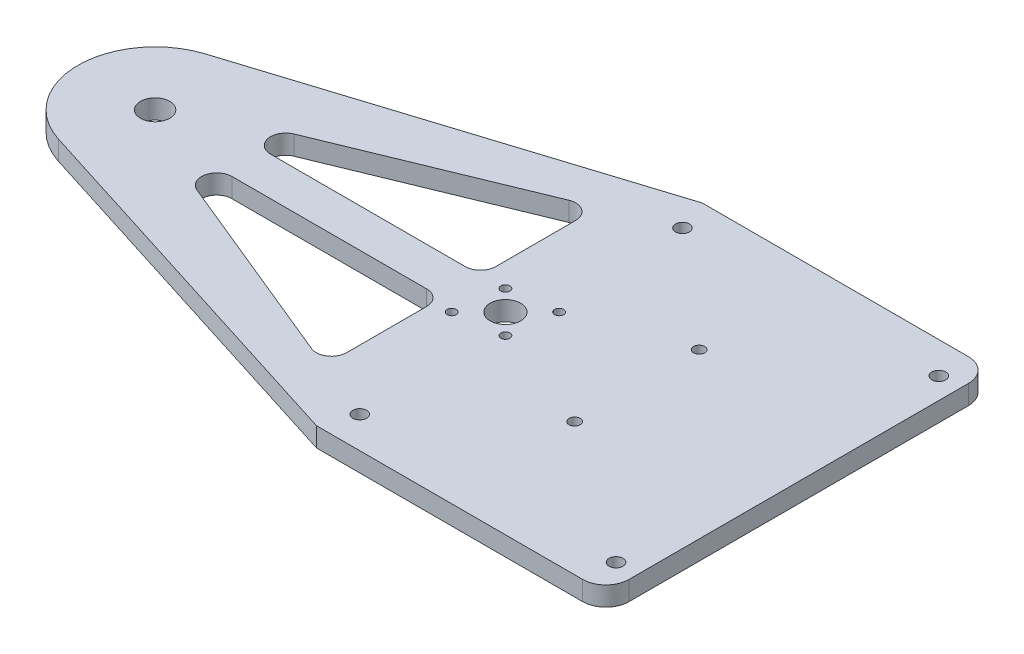
ISO-10303-21;
HEADER;
FILE_DESCRIPTION(('STEP AP214'),'2;1');
FILE_NAME('part.step','',(''),(''),'','','');
FILE_SCHEMA(('AUTOMOTIVE_DESIGN { 1 0 10303 214 1 1 1 1 }'));
ENDSEC;
DATA;
#1=APPLICATION_CONTEXT('core data for automotive mechanical design processes');
#2=APPLICATION_PROTOCOL_DEFINITION('international standard','automotive_design',2000,#1);
#3=PRODUCT_CONTEXT('',#1,'mechanical');
#4=PRODUCT('Part','Part','',(#3));
#5=PRODUCT_RELATED_PRODUCT_CATEGORY('part','',(#4));
#6=PRODUCT_DEFINITION_FORMATION('','',#4);
#7=PRODUCT_DEFINITION_CONTEXT('part definition',#1,'design');
#8=PRODUCT_DEFINITION('design','',#6,#7);
#9=PRODUCT_DEFINITION_SHAPE('','',#8);
#10=(LENGTH_UNIT() NAMED_UNIT(*) SI_UNIT(.MILLI.,.METRE.));
#11=(NAMED_UNIT(*) PLANE_ANGLE_UNIT() SI_UNIT($,.RADIAN.));
#12=(NAMED_UNIT(*) SI_UNIT($,.STERADIAN.) SOLID_ANGLE_UNIT());
#13=UNCERTAINTY_MEASURE_WITH_UNIT(LENGTH_MEASURE(1.E-05),#10,'distance_accuracy_value','');
#14=(GEOMETRIC_REPRESENTATION_CONTEXT(3) GLOBAL_UNCERTAINTY_ASSIGNED_CONTEXT((#13)) GLOBAL_UNIT_ASSIGNED_CONTEXT((#10,
#11,#12)) REPRESENTATION_CONTEXT('',''));
#15=CARTESIAN_POINT('',(0.,0.,0.));
#16=DIRECTION('',(0.,0.,1.));
#17=DIRECTION('',(1.,0.,0.));
#18=AXIS2_PLACEMENT_3D('',#15,#16,#17);
#19=CARTESIAN_POINT('',(47.625,6.35,63.5));
#20=DIRECTION('',(-1.,0.,0.));
#21=DIRECTION('',(0.,0.,1.));
#22=AXIS2_PLACEMENT_3D('',#19,#20,#21);
#23=PLANE('',#22);
#24=DIRECTION('',(0.,0.,-1.));
#25=VECTOR('',#24,1.);
#26=CARTESIAN_POINT('',(47.625,6.35,63.5));
#27=LINE('',#26,#25);
#28=CARTESIAN_POINT('',(47.625,6.35,55.88));
#29=VERTEX_POINT('',#28);
#30=CARTESIAN_POINT('',(47.625,6.35,-55.88));
#31=VERTEX_POINT('',#30);
#32=EDGE_CURVE('E224',#29,#31,#27,.T.);
#33=ORIENTED_EDGE('',*,*,#32,.F.);
#34=DIRECTION('',(0.,-1.,0.));
#35=VECTOR('',#34,1.);
#36=CARTESIAN_POINT('',(47.625,6.35,55.88));
#37=LINE('',#36,#35);
#38=CARTESIAN_POINT('',(47.625,0.,55.88));
#39=VERTEX_POINT('',#38);
#40=EDGE_CURVE('E289',#29,#39,#37,.T.);
#41=ORIENTED_EDGE('',*,*,#40,.T.);
#42=DIRECTION('',(0.,0.,-1.));
#43=VECTOR('',#42,1.);
#44=CARTESIAN_POINT('',(47.625,0.,63.5));
#45=LINE('',#44,#43);
#46=CARTESIAN_POINT('',(47.625,0.,-55.88));
#47=VERTEX_POINT('',#46);
#48=EDGE_CURVE('E186',#39,#47,#45,.T.);
#49=ORIENTED_EDGE('',*,*,#48,.T.);
#50=DIRECTION('',(0.,-1.,0.));
#51=VECTOR('',#50,1.);
#52=CARTESIAN_POINT('',(47.625,6.35,-55.88));
#53=LINE('',#52,#51);
#54=EDGE_CURVE('E287',#47,#31,#53,.F.);
#55=ORIENTED_EDGE('',*,*,#54,.T.);
#56=EDGE_LOOP('',(#33,#41,#49,#55));
#57=FACE_BOUND('',#56,.T.);
#58=ADVANCED_FACE('F38',(#57),#23,.F.);
#59=CARTESIAN_POINT('',(-47.625,6.35,-63.5));
#60=DIRECTION('',(0.,0.,1.));
#61=DIRECTION('',(1.,0.,0.));
#62=AXIS2_PLACEMENT_3D('',#59,#60,#61);
#63=PLANE('',#62);
#64=DIRECTION('',(-1.,0.,0.));
#65=VECTOR('',#64,1.);
#66=CARTESIAN_POINT('',(-47.625,6.35,-63.5));
#67=LINE('',#66,#65);
#68=CARTESIAN_POINT('',(40.005,6.35,-63.5));
#69=VERTEX_POINT('',#68);
#70=CARTESIAN_POINT('',(-47.625,6.35,-63.5));
#71=VERTEX_POINT('',#70);
#72=EDGE_CURVE('E226',#69,#71,#67,.T.);
#73=ORIENTED_EDGE('',*,*,#72,.F.);
#74=DIRECTION('',(0.,-1.,0.));
#75=VECTOR('',#74,1.);
#76=CARTESIAN_POINT('',(40.005,6.35,-63.5));
#77=LINE('',#76,#75);
#78=CARTESIAN_POINT('',(40.005,0.,-63.5));
#79=VERTEX_POINT('',#78);
#80=EDGE_CURVE('E11',#69,#79,#77,.T.);
#81=ORIENTED_EDGE('',*,*,#80,.T.);
#82=DIRECTION('',(-1.,0.,0.));
#83=VECTOR('',#82,1.);
#84=CARTESIAN_POINT('',(-47.625,0.,-63.5));
#85=LINE('',#84,#83);
#86=CARTESIAN_POINT('',(-47.625,0.,-63.5));
#87=VERTEX_POINT('',#86);
#88=EDGE_CURVE('E177',#79,#87,#85,.T.);
#89=ORIENTED_EDGE('',*,*,#88,.T.);
#90=DIRECTION('',(0.,-1.,0.));
#91=VECTOR('',#90,1.);
#92=CARTESIAN_POINT('',(-47.625,6.35,-63.5));
#93=LINE('',#92,#91);
#94=EDGE_CURVE('E180',#71,#87,#93,.T.);
#95=ORIENTED_EDGE('',*,*,#94,.F.);
#96=EDGE_LOOP('',(#73,#81,#89,#95));
#97=FACE_BOUND('',#96,.T.);
#98=ADVANCED_FACE('F179',(#97),#63,.F.);
#99=CARTESIAN_POINT('',(-47.625,6.35,63.5));
#100=DIRECTION('',(0.,0.,-1.));
#101=DIRECTION('',(-1.,0.,0.));
#102=AXIS2_PLACEMENT_3D('',#99,#100,#101);
#103=PLANE('',#102);
#104=DIRECTION('',(1.,0.,0.));
#105=VECTOR('',#104,1.);
#106=CARTESIAN_POINT('',(-47.625,0.,63.5));
#107=LINE('',#106,#105);
#108=CARTESIAN_POINT('',(-47.625,0.,63.5));
#109=VERTEX_POINT('',#108);
#110=CARTESIAN_POINT('',(40.005,0.,63.5));
#111=VERTEX_POINT('',#110);
#112=EDGE_CURVE('E185',#109,#111,#107,.T.);
#113=ORIENTED_EDGE('',*,*,#112,.T.);
#114=DIRECTION('',(0.,-1.,0.));
#115=VECTOR('',#114,1.);
#116=CARTESIAN_POINT('',(40.005,6.35,63.5));
#117=LINE('',#116,#115);
#118=CARTESIAN_POINT('',(40.005,6.35,63.5));
#119=VERTEX_POINT('',#118);
#120=EDGE_CURVE('E61',#111,#119,#117,.F.);
#121=ORIENTED_EDGE('',*,*,#120,.T.);
#122=DIRECTION('',(1.,0.,0.));
#123=VECTOR('',#122,1.);
#124=CARTESIAN_POINT('',(-47.625,6.35,63.5));
#125=LINE('',#124,#123);
#126=CARTESIAN_POINT('',(-47.625,6.35,63.5));
#127=VERTEX_POINT('',#126);
#128=EDGE_CURVE('E228',#127,#119,#125,.T.);
#129=ORIENTED_EDGE('',*,*,#128,.F.);
#130=DIRECTION('',(0.,-1.,0.));
#131=VECTOR('',#130,1.);
#132=CARTESIAN_POINT('',(-47.625,6.35,63.5));
#133=LINE('',#132,#131);
#134=EDGE_CURVE('E195',#127,#109,#133,.T.);
#135=ORIENTED_EDGE('',*,*,#134,.T.);
#136=EDGE_LOOP('',(#113,#121,#129,#135));
#137=FACE_BOUND('',#136,.T.);
#138=ADVANCED_FACE('F306',(#137),#103,.F.);
#139=CARTESIAN_POINT('',(0.,6.35,0.));
#140=DIRECTION('',(0.,-1.,0.));
#141=DIRECTION('',(0.,0.,-1.));
#142=AXIS2_PLACEMENT_3D('',#139,#140,#141);
#143=PLANE('',#142);
#144=CARTESIAN_POINT('',(-6.32846504664037,6.35,19.8289248425364));
#145=DIRECTION('',(0.,1.,0.));
#146=DIRECTION('',(0.,0.,1.));
#147=AXIS2_PLACEMENT_3D('',#144,#145,#146);
#148=CIRCLE('',#147,1.83000808299);
#149=CARTESIAN_POINT('',(-6.32846504664037,6.35,21.6589329255264));
#150=VERTEX_POINT('',#149);
#151=EDGE_CURVE('E530',#150,#150,#148,.T.);
#152=ORIENTED_EDGE('',*,*,#151,.F.);
#153=EDGE_LOOP('',(#152));
#154=FACE_BOUND('',#153,.T.);
#155=CARTESIAN_POINT('',(-6.32833804564912,6.35,-21.1714909607088));
#156=DIRECTION('',(0.,1.,0.));
#157=DIRECTION('',(0.,0.,1.));
#158=AXIS2_PLACEMENT_3D('',#155,#156,#157);
#159=CIRCLE('',#158,1.83000808299);
#160=CARTESIAN_POINT('',(-6.32833804564912,6.35,-19.3414828777188));
#161=VERTEX_POINT('',#160);
#162=EDGE_CURVE('E524',#161,#161,#159,.T.);
#163=ORIENTED_EDGE('',*,*,#162,.F.);
#164=EDGE_LOOP('',(#163));
#165=FACE_BOUND('',#164,.T.);
#166=CARTESIAN_POINT('',(40.6022546113919,6.35,53.1253834931554));
#167=DIRECTION('',(0.,1.,0.));
#168=DIRECTION('',(0.,0.,1.));
#169=AXIS2_PLACEMENT_3D('',#166,#167,#168);
#170=CIRCLE('',#169,2.2812375);
#171=CARTESIAN_POINT('',(40.6022546113919,6.35,55.4066209931554));
#172=VERTEX_POINT('',#171);
#173=EDGE_CURVE('E506',#172,#172,#170,.T.);
#174=ORIENTED_EDGE('',*,*,#173,.F.);
#175=EDGE_LOOP('',(#174));
#176=FACE_BOUND('',#175,.T.);
#177=CARTESIAN_POINT('',(40.6022546113918,6.35,-53.1253834931555));
#178=DIRECTION('',(0.,1.,0.));
#179=DIRECTION('',(0.,0.,1.));
#180=AXIS2_PLACEMENT_3D('',#177,#178,#179);
#181=CIRCLE('',#180,2.2812375);
#182=CARTESIAN_POINT('',(40.6022546113918,6.35,-50.8441459931555));
#183=VERTEX_POINT('',#182);
#184=EDGE_CURVE('E513',#183,#183,#181,.T.);
#185=ORIENTED_EDGE('',*,*,#184,.F.);
#186=EDGE_LOOP('',(#185));
#187=FACE_BOUND('',#186,.T.);
#188=CARTESIAN_POINT('',(-43.7772546113918,6.35,-53.1253834931554));
#189=DIRECTION('',(0.,1.,0.));
#190=DIRECTION('',(0.,0.,1.));
#191=AXIS2_PLACEMENT_3D('',#188,#189,#190);
#192=CIRCLE('',#191,2.2812375);
#193=CARTESIAN_POINT('',(-43.7772546113918,6.35,-50.8441459931554));
#194=VERTEX_POINT('',#193);
#195=EDGE_CURVE('E519',#194,#194,#192,.T.);
#196=ORIENTED_EDGE('',*,*,#195,.F.);
#197=EDGE_LOOP('',(#196));
#198=FACE_BOUND('',#197,.T.);
#199=CARTESIAN_POINT('',(-43.7772546113918,6.35,53.1253834931554));
#200=DIRECTION('',(0.,1.,0.));
#201=DIRECTION('',(0.,0.,1.));
#202=AXIS2_PLACEMENT_3D('',#199,#200,#201);
#203=CIRCLE('',#202,2.2812375);
#204=CARTESIAN_POINT('',(-43.7772546113918,6.35,55.4066209931554));
#205=VERTEX_POINT('',#204);
#206=EDGE_CURVE('E500',#205,#205,#203,.T.);
#207=ORIENTED_EDGE('',*,*,#206,.F.);
#208=EDGE_LOOP('',(#207));
#209=FACE_BOUND('',#208,.T.);
#210=DIRECTION('',(-0.924890770713384,0.,0.380232905268865));
#211=VECTOR('',#210,1.);
#212=CARTESIAN_POINT('',(-63.5,6.35,-45.1637433547681));
#213=LINE('',#212,#211);
#214=CARTESIAN_POINT('',(-70.4011645263443,6.35,-42.3265976931606));
#215=VERTEX_POINT('',#214);
#216=CARTESIAN_POINT('',(-134.500968325591,6.35,-15.9744538535669));
#217=VERTEX_POINT('',#216);
#218=EDGE_CURVE('E488',#215,#217,#213,.T.);
#219=ORIENTED_EDGE('',*,*,#218,.F.);
#220=CARTESIAN_POINT('',(-68.5,6.35,-37.7021438395937));
#221=DIRECTION('',(0.,-1.,0.));
#222=DIRECTION('',(0.,0.,-1.));
#223=AXIS2_PLACEMENT_3D('',#220,#221,#222);
#224=CIRCLE('',#223,5.);
#225=CARTESIAN_POINT('',(-63.5,6.35,-37.7021438395937));
#226=VERTEX_POINT('',#225);
#227=EDGE_CURVE('E283',#215,#226,#224,.T.);
#228=ORIENTED_EDGE('',*,*,#227,.T.);
#229=DIRECTION('',(0.,0.,-1.));
#230=VECTOR('',#229,1.);
#231=CARTESIAN_POINT('',(-63.5,6.35,-6.34999999999999));
#232=LINE('',#231,#230);
#233=CARTESIAN_POINT('',(-63.5,6.35,-11.35));
#234=VERTEX_POINT('',#233);
#235=EDGE_CURVE('E478',#234,#226,#232,.T.);
#236=ORIENTED_EDGE('',*,*,#235,.F.);
#237=CARTESIAN_POINT('',(-68.5,6.35,-11.35));
#238=DIRECTION('',(0.,-1.,0.));
#239=DIRECTION('',(0.,0.,-1.));
#240=AXIS2_PLACEMENT_3D('',#237,#238,#239);
#241=CIRCLE('',#240,5.);
#242=CARTESIAN_POINT('',(-68.5,6.35,-6.34999999999999));
#243=VERTEX_POINT('',#242);
#244=EDGE_CURVE('E275',#234,#243,#241,.T.);
#245=ORIENTED_EDGE('',*,*,#244,.T.);
#246=DIRECTION('',(1.,0.,0.));
#247=VECTOR('',#246,1.);
#248=CARTESIAN_POINT('',(-157.9118,6.35,-6.34999999999997));
#249=LINE('',#248,#247);
#250=CARTESIAN_POINT('',(-132.599803799247,6.35,-6.34999999999998));
#251=VERTEX_POINT('',#250);
#252=EDGE_CURVE('E484',#251,#243,#249,.T.);
#253=ORIENTED_EDGE('',*,*,#252,.F.);
#254=CARTESIAN_POINT('',(-132.599803799247,6.35,-11.35));
#255=DIRECTION('',(0.,-1.,0.));
#256=DIRECTION('',(0.,0.,-1.));
#257=AXIS2_PLACEMENT_3D('',#254,#255,#256);
#258=CIRCLE('',#257,5.);
#259=EDGE_CURVE('E279',#251,#217,#258,.T.);
#260=ORIENTED_EDGE('',*,*,#259,.T.);
#261=EDGE_LOOP('',(#219,#228,#236,#245,#253,#260));
#262=FACE_BOUND('',#261,.T.);
#263=DIRECTION('',(0.924890770713385,0.,0.380232905268865));
#264=VECTOR('',#263,1.);
#265=CARTESIAN_POINT('',(-63.5,6.35,45.1637433547681));
#266=LINE('',#265,#264);
#267=CARTESIAN_POINT('',(-134.500968325591,6.35,15.9744538535669));
#268=VERTEX_POINT('',#267);
#269=CARTESIAN_POINT('',(-70.4011645263443,6.35,42.3265976931606));
#270=VERTEX_POINT('',#269);
#271=EDGE_CURVE('E468',#268,#270,#266,.T.);
#272=ORIENTED_EDGE('',*,*,#271,.F.);
#273=CARTESIAN_POINT('',(-132.599803799247,6.35,11.35));
#274=DIRECTION('',(0.,-1.,0.));
#275=DIRECTION('',(0.,0.,-1.));
#276=AXIS2_PLACEMENT_3D('',#273,#274,#275);
#277=CIRCLE('',#276,5.);
#278=CARTESIAN_POINT('',(-132.599803799247,6.35,6.35000000000001));
#279=VERTEX_POINT('',#278);
#280=EDGE_CURVE('E263',#268,#279,#277,.T.);
#281=ORIENTED_EDGE('',*,*,#280,.T.);
#282=DIRECTION('',(-1.,0.,0.));
#283=VECTOR('',#282,1.);
#284=CARTESIAN_POINT('',(-157.9118,6.35,6.35000000000001));
#285=LINE('',#284,#283);
#286=CARTESIAN_POINT('',(-68.5,6.35,6.35000000000001));
#287=VERTEX_POINT('',#286);
#288=EDGE_CURVE('E471',#287,#279,#285,.T.);
#289=ORIENTED_EDGE('',*,*,#288,.F.);
#290=CARTESIAN_POINT('',(-68.5,6.35,11.35));
#291=DIRECTION('',(0.,-1.,0.));
#292=DIRECTION('',(0.,0.,-1.));
#293=AXIS2_PLACEMENT_3D('',#290,#291,#292);
#294=CIRCLE('',#293,5.);
#295=CARTESIAN_POINT('',(-63.5,6.35,11.35));
#296=VERTEX_POINT('',#295);
#297=EDGE_CURVE('E267',#287,#296,#294,.T.);
#298=ORIENTED_EDGE('',*,*,#297,.T.);
#299=DIRECTION('',(0.,0.,-1.));
#300=VECTOR('',#299,1.);
#301=CARTESIAN_POINT('',(-63.5,6.35,6.35000000000001));
#302=LINE('',#301,#300);
#303=CARTESIAN_POINT('',(-63.5,6.35,37.7021438395937));
#304=VERTEX_POINT('',#303);
#305=EDGE_CURVE('E464',#304,#296,#302,.T.);
#306=ORIENTED_EDGE('',*,*,#305,.F.);
#307=CARTESIAN_POINT('',(-68.5,6.35,37.7021438395937));
#308=DIRECTION('',(0.,-1.,0.));
#309=DIRECTION('',(0.,0.,-1.));
#310=AXIS2_PLACEMENT_3D('',#307,#308,#309);
#311=CIRCLE('',#310,5.);
#312=EDGE_CURVE('E271',#304,#270,#311,.T.);
#313=ORIENTED_EDGE('',*,*,#312,.T.);
#314=EDGE_LOOP('',(#272,#281,#289,#298,#306,#313));
#315=FACE_BOUND('',#314,.T.);
#316=CARTESIAN_POINT('',(-164.2618,6.35,0.));
#317=DIRECTION('',(0.,1.,0.));
#318=DIRECTION('',(0.,0.,1.));
#319=AXIS2_PLACEMENT_3D('',#316,#317,#318);
#320=CIRCLE('',#319,4.82599999999999);
#321=CARTESIAN_POINT('',(-164.2618,6.35,4.82599999999999));
#322=VERTEX_POINT('',#321);
#323=EDGE_CURVE('E453',#322,#322,#320,.T.);
#324=ORIENTED_EDGE('',*,*,#323,.F.);
#325=EDGE_LOOP('',(#324));
#326=FACE_BOUND('',#325,.T.);
#327=CARTESIAN_POINT('',(-42.2282855787278,6.35,6.71751442127221));
#328=DIRECTION('',(0.,1.,0.));
#329=DIRECTION('',(0.,0.,1.));
#330=AXIS2_PLACEMENT_3D('',#327,#328,#329);
#331=CIRCLE('',#330,1.50000000000004);
#332=CARTESIAN_POINT('',(-42.2282855787278,6.35,8.21751442127225));
#333=VERTEX_POINT('',#332);
#334=EDGE_CURVE('E437',#333,#333,#331,.T.);
#335=ORIENTED_EDGE('',*,*,#334,.F.);
#336=EDGE_LOOP('',(#335));
#337=FACE_BOUND('',#336,.T.);
#338=CARTESIAN_POINT('',(-55.6633144212722,6.35,-6.71751442127223));
#339=DIRECTION('',(0.,1.,0.));
#340=DIRECTION('',(0.,0.,1.));
#341=AXIS2_PLACEMENT_3D('',#338,#339,#340);
#342=CIRCLE('',#341,1.50000000000004);
#343=CARTESIAN_POINT('',(-55.6633144212722,6.35,-5.21751442127219));
#344=VERTEX_POINT('',#343);
#345=EDGE_CURVE('E431',#344,#344,#342,.T.);
#346=ORIENTED_EDGE('',*,*,#345,.F.);
#347=EDGE_LOOP('',(#346));
#348=FACE_BOUND('',#347,.T.);
#349=CARTESIAN_POINT('',(-57.7846347648318,6.35,8.83883476483181));
#350=DIRECTION('',(0.,1.,0.));
#351=DIRECTION('',(0.,0.,1.));
#352=AXIS2_PLACEMENT_3D('',#349,#350,#351);
#353=CIRCLE('',#352,1.50000000000004);
#354=CARTESIAN_POINT('',(-57.7846347648318,6.35,10.3388347648319));
#355=VERTEX_POINT('',#354);
#356=EDGE_CURVE('E435',#355,#355,#353,.T.);
#357=ORIENTED_EDGE('',*,*,#356,.F.);
#358=EDGE_LOOP('',(#357));
#359=FACE_BOUND('',#358,.T.);
#360=CARTESIAN_POINT('',(-40.1069652351681,6.35,-8.83883476483183));
#361=DIRECTION('',(0.,1.,0.));
#362=DIRECTION('',(0.,0.,1.));
#363=AXIS2_PLACEMENT_3D('',#360,#361,#362);
#364=CIRCLE('',#363,1.50000000000004);
#365=CARTESIAN_POINT('',(-40.1069652351681,6.35,-7.33883476483179));
#366=VERTEX_POINT('',#365);
#367=EDGE_CURVE('E444',#366,#366,#364,.T.);
#368=ORIENTED_EDGE('',*,*,#367,.F.);
#369=EDGE_LOOP('',(#368));
#370=FACE_BOUND('',#369,.T.);
#371=CARTESIAN_POINT('',(-48.9458,6.35,0.));
#372=DIRECTION('',(0.,1.,0.));
#373=DIRECTION('',(0.,0.,1.));
#374=AXIS2_PLACEMENT_3D('',#371,#372,#373);
#375=CIRCLE('',#374,5.039999953);
#376=CARTESIAN_POINT('',(-48.9458,6.35,5.039999953));
#377=VERTEX_POINT('',#376);
#378=EDGE_CURVE('E450',#377,#377,#375,.T.);
#379=ORIENTED_EDGE('',*,*,#378,.F.);
#380=EDGE_LOOP('',(#379));
#381=FACE_BOUND('',#380,.T.);
#382=ORIENTED_EDGE('',*,*,#128,.T.);
#383=CARTESIAN_POINT('',(40.005,6.35,55.88));
#384=DIRECTION('',(0.,-1.,0.));
#385=DIRECTION('',(0.,0.,-1.));
#386=AXIS2_PLACEMENT_3D('',#383,#384,#385);
#387=CIRCLE('',#386,7.62);
#388=EDGE_CURVE('E46',#119,#29,#387,.F.);
#389=ORIENTED_EDGE('',*,*,#388,.T.);
#390=ORIENTED_EDGE('',*,*,#32,.T.);
#391=CARTESIAN_POINT('',(40.005,6.35,-55.88));
#392=DIRECTION('',(0.,-1.,0.));
#393=DIRECTION('',(0.,0.,-1.));
#394=AXIS2_PLACEMENT_3D('',#391,#392,#393);
#395=CIRCLE('',#394,7.62);
#396=EDGE_CURVE('E53',#31,#69,#395,.F.);
#397=ORIENTED_EDGE('',*,*,#396,.T.);
#398=ORIENTED_EDGE('',*,*,#72,.T.);
#399=DIRECTION('',(-0.953514489025035,0.,0.301347173903003));
#400=VECTOR('',#399,1.);
#401=CARTESIAN_POINT('',(-47.625,6.35,-63.5));
#402=LINE('',#401,#400);
#403=CARTESIAN_POINT('',(-171.916018217136,6.35,-24.2192680212359));
#404=VERTEX_POINT('',#403);
#405=EDGE_CURVE('E193',#71,#404,#402,.T.);
#406=ORIENTED_EDGE('',*,*,#405,.T.);
#407=CARTESIAN_POINT('',(-164.2618,6.35,0.));
#408=DIRECTION('',(0.,1.,0.));
#409=DIRECTION('',(0.,0.,1.));
#410=AXIS2_PLACEMENT_3D('',#407,#408,#409);
#411=CIRCLE('',#410,25.4);
#412=CARTESIAN_POINT('',(-171.916018217136,6.35,24.2192680212359));
#413=VERTEX_POINT('',#412);
#414=EDGE_CURVE('E208',#404,#413,#411,.T.);
#415=ORIENTED_EDGE('',*,*,#414,.T.);
#416=DIRECTION('',(0.953514489025035,0.,0.301347173903003));
#417=VECTOR('',#416,1.);
#418=CARTESIAN_POINT('',(-47.625,6.35,63.5));
#419=LINE('',#418,#417);
#420=EDGE_CURVE('E203',#413,#127,#419,.T.);
#421=ORIENTED_EDGE('',*,*,#420,.T.);
#422=EDGE_LOOP('',(#382,#389,#390,#397,#398,#406,#415,#421));
#423=FACE_BOUND('',#422,.T.);
#424=ADVANCED_FACE('F299',(#154,#165,#176,#187,#198,#209,#262,#315,#326,#337,#348,#359,#370,
#381,#423),#143,.F.);
#425=CARTESIAN_POINT('',(0.,0.,0.));
#426=DIRECTION('',(0.,-1.,0.));
#427=DIRECTION('',(0.,0.,-1.));
#428=AXIS2_PLACEMENT_3D('',#425,#426,#427);
#429=PLANE('',#428);
#430=CARTESIAN_POINT('',(-6.32846504664037,0.,19.8289248425364));
#431=DIRECTION('',(0.,1.,0.));
#432=DIRECTION('',(0.,0.,1.));
#433=AXIS2_PLACEMENT_3D('',#430,#431,#432);
#434=CIRCLE('',#433,1.83000808299);
#435=CARTESIAN_POINT('',(-6.32846504664037,0.,21.6589329255264));
#436=VERTEX_POINT('',#435);
#437=EDGE_CURVE('E510',#436,#436,#434,.T.);
#438=ORIENTED_EDGE('',*,*,#437,.T.);
#439=EDGE_LOOP('',(#438));
#440=FACE_BOUND('',#439,.T.);
#441=CARTESIAN_POINT('',(-6.32833804564912,0.,-21.1714909607088));
#442=DIRECTION('',(0.,1.,0.));
#443=DIRECTION('',(0.,0.,1.));
#444=AXIS2_PLACEMENT_3D('',#441,#442,#443);
#445=CIRCLE('',#444,1.83000808299);
#446=CARTESIAN_POINT('',(-6.32833804564912,0.,-19.3414828777188));
#447=VERTEX_POINT('',#446);
#448=EDGE_CURVE('E527',#447,#447,#445,.T.);
#449=ORIENTED_EDGE('',*,*,#448,.T.);
#450=EDGE_LOOP('',(#449));
#451=FACE_BOUND('',#450,.T.);
#452=CARTESIAN_POINT('',(40.6022546113919,0.,53.1253834931554));
#453=DIRECTION('',(0.,1.,0.));
#454=DIRECTION('',(0.,0.,1.));
#455=AXIS2_PLACEMENT_3D('',#452,#453,#454);
#456=CIRCLE('',#455,2.2812375);
#457=CARTESIAN_POINT('',(40.6022546113919,0.,55.4066209931554));
#458=VERTEX_POINT('',#457);
#459=EDGE_CURVE('E509',#458,#458,#456,.T.);
#460=ORIENTED_EDGE('',*,*,#459,.T.);
#461=EDGE_LOOP('',(#460));
#462=FACE_BOUND('',#461,.T.);
#463=CARTESIAN_POINT('',(40.6022546113918,0.,-53.1253834931555));
#464=DIRECTION('',(0.,1.,0.));
#465=DIRECTION('',(0.,0.,1.));
#466=AXIS2_PLACEMENT_3D('',#463,#464,#465);
#467=CIRCLE('',#466,2.2812375);
#468=CARTESIAN_POINT('',(40.6022546113918,0.,-50.8441459931555));
#469=VERTEX_POINT('',#468);
#470=EDGE_CURVE('E516',#469,#469,#467,.T.);
#471=ORIENTED_EDGE('',*,*,#470,.T.);
#472=EDGE_LOOP('',(#471));
#473=FACE_BOUND('',#472,.T.);
#474=CARTESIAN_POINT('',(-43.7772546113918,0.,-53.1253834931554));
#475=DIRECTION('',(0.,1.,0.));
#476=DIRECTION('',(0.,0.,1.));
#477=AXIS2_PLACEMENT_3D('',#474,#475,#476);
#478=CIRCLE('',#477,2.2812375);
#479=CARTESIAN_POINT('',(-43.7772546113918,0.,-50.8441459931554));
#480=VERTEX_POINT('',#479);
#481=EDGE_CURVE('E503',#480,#480,#478,.T.);
#482=ORIENTED_EDGE('',*,*,#481,.T.);
#483=EDGE_LOOP('',(#482));
#484=FACE_BOUND('',#483,.T.);
#485=CARTESIAN_POINT('',(-43.7772546113918,0.,53.1253834931554));
#486=DIRECTION('',(0.,1.,0.));
#487=DIRECTION('',(0.,0.,1.));
#488=AXIS2_PLACEMENT_3D('',#485,#486,#487);
#489=CIRCLE('',#488,2.2812375);
#490=CARTESIAN_POINT('',(-43.7772546113918,0.,55.4066209931554));
#491=VERTEX_POINT('',#490);
#492=EDGE_CURVE('E474',#491,#491,#489,.T.);
#493=ORIENTED_EDGE('',*,*,#492,.T.);
#494=EDGE_LOOP('',(#493));
#495=FACE_BOUND('',#494,.T.);
#496=DIRECTION('',(1.,0.,0.));
#497=VECTOR('',#496,1.);
#498=CARTESIAN_POINT('',(-157.9118,0.,-6.34999999999997));
#499=LINE('',#498,#497);
#500=CARTESIAN_POINT('',(-132.599803799247,0.,-6.34999999999998));
#501=VERTEX_POINT('',#500);
#502=CARTESIAN_POINT('',(-68.5,0.,-6.34999999999999));
#503=VERTEX_POINT('',#502);
#504=EDGE_CURVE('E457',#501,#503,#499,.T.);
#505=ORIENTED_EDGE('',*,*,#504,.T.);
#506=CARTESIAN_POINT('',(-68.5,0.,-11.35));
#507=DIRECTION('',(0.,-1.,0.));
#508=DIRECTION('',(0.,0.,-1.));
#509=AXIS2_PLACEMENT_3D('',#506,#507,#508);
#510=CIRCLE('',#509,5.);
#511=CARTESIAN_POINT('',(-63.5,0.,-11.35));
#512=VERTEX_POINT('',#511);
#513=EDGE_CURVE('E277',#503,#512,#510,.F.);
#514=ORIENTED_EDGE('',*,*,#513,.T.);
#515=DIRECTION('',(0.,0.,-1.));
#516=VECTOR('',#515,1.);
#517=CARTESIAN_POINT('',(-63.5,0.,-6.34999999999999));
#518=LINE('',#517,#516);
#519=CARTESIAN_POINT('',(-63.5,0.,-37.7021438395937));
#520=VERTEX_POINT('',#519);
#521=EDGE_CURVE('E487',#512,#520,#518,.T.);
#522=ORIENTED_EDGE('',*,*,#521,.T.);
#523=CARTESIAN_POINT('',(-68.5,0.,-37.7021438395937));
#524=DIRECTION('',(0.,-1.,0.));
#525=DIRECTION('',(0.,0.,-1.));
#526=AXIS2_PLACEMENT_3D('',#523,#524,#525);
#527=CIRCLE('',#526,5.);
#528=CARTESIAN_POINT('',(-70.4011645263443,0.,-42.3265976931606));
#529=VERTEX_POINT('',#528);
#530=EDGE_CURVE('E285',#520,#529,#527,.F.);
#531=ORIENTED_EDGE('',*,*,#530,.T.);
#532=DIRECTION('',(-0.924890770713384,0.,0.380232905268865));
#533=VECTOR('',#532,1.);
#534=CARTESIAN_POINT('',(-63.5,0.,-45.1637433547681));
#535=LINE('',#534,#533);
#536=CARTESIAN_POINT('',(-134.500968325591,0.,-15.9744538535669));
#537=VERTEX_POINT('',#536);
#538=EDGE_CURVE('E495',#529,#537,#535,.T.);
#539=ORIENTED_EDGE('',*,*,#538,.T.);
#540=CARTESIAN_POINT('',(-132.599803799247,0.,-11.35));
#541=DIRECTION('',(0.,-1.,0.));
#542=DIRECTION('',(0.,0.,-1.));
#543=AXIS2_PLACEMENT_3D('',#540,#541,#542);
#544=CIRCLE('',#543,5.);
#545=EDGE_CURVE('E281',#537,#501,#544,.F.);
#546=ORIENTED_EDGE('',*,*,#545,.T.);
#547=EDGE_LOOP('',(#505,#514,#522,#531,#539,#546));
#548=FACE_BOUND('',#547,.T.);
#549=DIRECTION('',(0.,0.,-1.));
#550=VECTOR('',#549,1.);
#551=CARTESIAN_POINT('',(-63.5,0.,6.35000000000001));
#552=LINE('',#551,#550);
#553=CARTESIAN_POINT('',(-63.5,0.,37.7021438395937));
#554=VERTEX_POINT('',#553);
#555=CARTESIAN_POINT('',(-63.5,0.,11.35));
#556=VERTEX_POINT('',#555);
#557=EDGE_CURVE('E475',#554,#556,#552,.T.);
#558=ORIENTED_EDGE('',*,*,#557,.T.);
#559=CARTESIAN_POINT('',(-68.5,0.,11.35));
#560=DIRECTION('',(0.,-1.,0.));
#561=DIRECTION('',(0.,0.,-1.));
#562=AXIS2_PLACEMENT_3D('',#559,#560,#561);
#563=CIRCLE('',#562,5.);
#564=CARTESIAN_POINT('',(-68.5,0.,6.35000000000001));
#565=VERTEX_POINT('',#564);
#566=EDGE_CURVE('E269',#556,#565,#563,.F.);
#567=ORIENTED_EDGE('',*,*,#566,.T.);
#568=DIRECTION('',(-1.,0.,0.));
#569=VECTOR('',#568,1.);
#570=CARTESIAN_POINT('',(-157.9118,0.,6.35000000000001));
#571=LINE('',#570,#569);
#572=CARTESIAN_POINT('',(-132.599803799247,0.,6.35000000000001));
#573=VERTEX_POINT('',#572);
#574=EDGE_CURVE('E467',#565,#573,#571,.T.);
#575=ORIENTED_EDGE('',*,*,#574,.T.);
#576=CARTESIAN_POINT('',(-132.599803799247,0.,11.35));
#577=DIRECTION('',(0.,-1.,0.));
#578=DIRECTION('',(0.,0.,-1.));
#579=AXIS2_PLACEMENT_3D('',#576,#577,#578);
#580=CIRCLE('',#579,5.);
#581=CARTESIAN_POINT('',(-134.500968325591,0.,15.9744538535669));
#582=VERTEX_POINT('',#581);
#583=EDGE_CURVE('E265',#573,#582,#580,.F.);
#584=ORIENTED_EDGE('',*,*,#583,.T.);
#585=DIRECTION('',(0.924890770713385,0.,0.380232905268865));
#586=VECTOR('',#585,1.);
#587=CARTESIAN_POINT('',(-63.5,0.,45.1637433547681));
#588=LINE('',#587,#586);
#589=CARTESIAN_POINT('',(-70.4011645263443,0.,42.3265976931606));
#590=VERTEX_POINT('',#589);
#591=EDGE_CURVE('E479',#582,#590,#588,.T.);
#592=ORIENTED_EDGE('',*,*,#591,.T.);
#593=CARTESIAN_POINT('',(-68.5,0.,37.7021438395937));
#594=DIRECTION('',(0.,-1.,0.));
#595=DIRECTION('',(0.,0.,-1.));
#596=AXIS2_PLACEMENT_3D('',#593,#594,#595);
#597=CIRCLE('',#596,5.);
#598=EDGE_CURVE('E273',#590,#554,#597,.F.);
#599=ORIENTED_EDGE('',*,*,#598,.T.);
#600=EDGE_LOOP('',(#558,#567,#575,#584,#592,#599));
#601=FACE_BOUND('',#600,.T.);
#602=CARTESIAN_POINT('',(-164.2618,0.,0.));
#603=DIRECTION('',(0.,1.,0.));
#604=DIRECTION('',(0.,0.,1.));
#605=AXIS2_PLACEMENT_3D('',#602,#603,#604);
#606=CIRCLE('',#605,4.82599999999999);
#607=CARTESIAN_POINT('',(-164.2618,0.,4.82599999999999));
#608=VERTEX_POINT('',#607);
#609=EDGE_CURVE('E218',#608,#608,#606,.T.);
#610=ORIENTED_EDGE('',*,*,#609,.T.);
#611=EDGE_LOOP('',(#610));
#612=FACE_BOUND('',#611,.T.);
#613=CARTESIAN_POINT('',(-42.2282855787278,0.,6.71751442127221));
#614=DIRECTION('',(0.,1.,0.));
#615=DIRECTION('',(0.,0.,1.));
#616=AXIS2_PLACEMENT_3D('',#613,#614,#615);
#617=CIRCLE('',#616,1.50000000000004);
#618=CARTESIAN_POINT('',(-42.2282855787278,0.,8.21751442127225));
#619=VERTEX_POINT('',#618);
#620=EDGE_CURVE('E454',#619,#619,#617,.T.);
#621=ORIENTED_EDGE('',*,*,#620,.T.);
#622=EDGE_LOOP('',(#621));
#623=FACE_BOUND('',#622,.T.);
#624=CARTESIAN_POINT('',(-55.6633144212722,0.,-6.71751442127223));
#625=DIRECTION('',(0.,1.,0.));
#626=DIRECTION('',(0.,0.,1.));
#627=AXIS2_PLACEMENT_3D('',#624,#625,#626);
#628=CIRCLE('',#627,1.50000000000004);
#629=CARTESIAN_POINT('',(-55.6633144212722,0.,-5.21751442127219));
#630=VERTEX_POINT('',#629);
#631=EDGE_CURVE('E211',#630,#630,#628,.T.);
#632=ORIENTED_EDGE('',*,*,#631,.T.);
#633=EDGE_LOOP('',(#632));
#634=FACE_BOUND('',#633,.T.);
#635=CARTESIAN_POINT('',(-57.7846347648318,0.,8.83883476483181));
#636=DIRECTION('',(0.,1.,0.));
#637=DIRECTION('',(0.,0.,1.));
#638=AXIS2_PLACEMENT_3D('',#635,#636,#637);
#639=CIRCLE('',#638,1.50000000000004);
#640=CARTESIAN_POINT('',(-57.7846347648318,0.,10.3388347648319));
#641=VERTEX_POINT('',#640);
#642=EDGE_CURVE('E433',#641,#641,#639,.T.);
#643=ORIENTED_EDGE('',*,*,#642,.T.);
#644=EDGE_LOOP('',(#643));
#645=FACE_BOUND('',#644,.T.);
#646=CARTESIAN_POINT('',(-40.1069652351681,0.,-8.83883476483183));
#647=DIRECTION('',(0.,1.,0.));
#648=DIRECTION('',(0.,0.,1.));
#649=AXIS2_PLACEMENT_3D('',#646,#647,#648);
#650=CIRCLE('',#649,1.50000000000004);
#651=CARTESIAN_POINT('',(-40.1069652351681,0.,-7.33883476483179));
#652=VERTEX_POINT('',#651);
#653=EDGE_CURVE('E441',#652,#652,#650,.T.);
#654=ORIENTED_EDGE('',*,*,#653,.T.);
#655=EDGE_LOOP('',(#654));
#656=FACE_BOUND('',#655,.T.);
#657=CARTESIAN_POINT('',(-48.9458,0.,0.));
#658=DIRECTION('',(0.,1.,0.));
#659=DIRECTION('',(0.,0.,1.));
#660=AXIS2_PLACEMENT_3D('',#657,#658,#659);
#661=CIRCLE('',#660,5.039999953);
#662=CARTESIAN_POINT('',(-48.9458,0.,5.039999953));
#663=VERTEX_POINT('',#662);
#664=EDGE_CURVE('E447',#663,#663,#661,.T.);
#665=ORIENTED_EDGE('',*,*,#664,.T.);
#666=EDGE_LOOP('',(#665));
#667=FACE_BOUND('',#666,.T.);
#668=ORIENTED_EDGE('',*,*,#48,.F.);
#669=CARTESIAN_POINT('',(40.005,0.,55.88));
#670=DIRECTION('',(0.,-1.,0.));
#671=DIRECTION('',(0.,0.,-1.));
#672=AXIS2_PLACEMENT_3D('',#669,#670,#671);
#673=CIRCLE('',#672,7.62);
#674=EDGE_CURVE('E294',#39,#111,#673,.T.);
#675=ORIENTED_EDGE('',*,*,#674,.T.);
#676=ORIENTED_EDGE('',*,*,#112,.F.);
#677=DIRECTION('',(0.953514489025035,0.,0.301347173903003));
#678=VECTOR('',#677,1.);
#679=CARTESIAN_POINT('',(-47.625,0.,63.5));
#680=LINE('',#679,#678);
#681=CARTESIAN_POINT('',(-171.916018217136,0.,24.2192680212359));
#682=VERTEX_POINT('',#681);
#683=EDGE_CURVE('E205',#682,#109,#680,.T.);
#684=ORIENTED_EDGE('',*,*,#683,.F.);
#685=CARTESIAN_POINT('',(-164.2618,0.,0.));
#686=DIRECTION('',(0.,1.,0.));
#687=DIRECTION('',(0.,0.,1.));
#688=AXIS2_PLACEMENT_3D('',#685,#686,#687);
#689=CIRCLE('',#688,25.4);
#690=CARTESIAN_POINT('',(-171.916018217136,0.,-24.2192680212359));
#691=VERTEX_POINT('',#690);
#692=EDGE_CURVE('E202',#691,#682,#689,.T.);
#693=ORIENTED_EDGE('',*,*,#692,.F.);
#694=DIRECTION('',(-0.953514489025035,0.,0.301347173903003));
#695=VECTOR('',#694,1.);
#696=CARTESIAN_POINT('',(-47.625,0.,-63.5));
#697=LINE('',#696,#695);
#698=EDGE_CURVE('E191',#87,#691,#697,.T.);
#699=ORIENTED_EDGE('',*,*,#698,.F.);
#700=ORIENTED_EDGE('',*,*,#88,.F.);
#701=CARTESIAN_POINT('',(40.005,0.,-55.88));
#702=DIRECTION('',(0.,-1.,0.));
#703=DIRECTION('',(0.,0.,-1.));
#704=AXIS2_PLACEMENT_3D('',#701,#702,#703);
#705=CIRCLE('',#704,7.62);
#706=EDGE_CURVE('E292',#79,#47,#705,.T.);
#707=ORIENTED_EDGE('',*,*,#706,.T.);
#708=EDGE_LOOP('',(#668,#675,#676,#684,#693,#699,#700,#707));
#709=FACE_BOUND('',#708,.T.);
#710=ADVANCED_FACE('F199',(#440,#451,#462,#473,#484,#495,#548,#601,#612,#623,#634,#645,#656,
#667,#709),#429,.T.);
#711=CARTESIAN_POINT('',(-47.625,0.,63.5));
#712=DIRECTION('',(-0.301347173903003,0.,0.953514489025035));
#713=DIRECTION('',(0.953514489025035,0.,0.301347173903003));
#714=AXIS2_PLACEMENT_3D('',#711,#712,#713);
#715=PLANE('',#714);
#716=ORIENTED_EDGE('',*,*,#420,.F.);
#717=DIRECTION('',(0.,1.,0.));
#718=VECTOR('',#717,1.);
#719=CARTESIAN_POINT('',(-171.916018217136,0.,24.2192680212359));
#720=LINE('',#719,#718);
#721=EDGE_CURVE('E221',#682,#413,#720,.T.);
#722=ORIENTED_EDGE('',*,*,#721,.F.);
#723=ORIENTED_EDGE('',*,*,#683,.T.);
#724=ORIENTED_EDGE('',*,*,#134,.F.);
#725=EDGE_LOOP('',(#716,#722,#723,#724));
#726=FACE_BOUND('',#725,.T.);
#727=ADVANCED_FACE('F310',(#726),#715,.T.);
#728=CARTESIAN_POINT('',(-164.2618,0.,0.));
#729=DIRECTION('',(0.,1.,0.));
#730=DIRECTION('',(0.,0.,1.));
#731=AXIS2_PLACEMENT_3D('',#728,#729,#730);
#732=CYLINDRICAL_SURFACE('',#731,25.4);
#733=ORIENTED_EDGE('',*,*,#414,.F.);
#734=DIRECTION('',(0.,1.,0.));
#735=VECTOR('',#734,1.);
#736=CARTESIAN_POINT('',(-171.916018217136,0.,-24.2192680212359));
#737=LINE('',#736,#735);
#738=EDGE_CURVE('E216',#691,#404,#737,.T.);
#739=ORIENTED_EDGE('',*,*,#738,.F.);
#740=ORIENTED_EDGE('',*,*,#692,.T.);
#741=ORIENTED_EDGE('',*,*,#721,.T.);
#742=EDGE_LOOP('',(#733,#739,#740,#741));
#743=FACE_BOUND('',#742,.T.);
#744=ADVANCED_FACE('F313',(#743),#732,.T.);
#745=CARTESIAN_POINT('',(-47.625,0.,-63.5));
#746=DIRECTION('',(-0.301347173903003,0.,-0.953514489025035));
#747=DIRECTION('',(-0.953514489025035,0.,0.301347173903003));
#748=AXIS2_PLACEMENT_3D('',#745,#746,#747);
#749=PLANE('',#748);
#750=ORIENTED_EDGE('',*,*,#405,.F.);
#751=ORIENTED_EDGE('',*,*,#94,.T.);
#752=ORIENTED_EDGE('',*,*,#698,.T.);
#753=ORIENTED_EDGE('',*,*,#738,.T.);
#754=EDGE_LOOP('',(#750,#751,#752,#753));
#755=FACE_BOUND('',#754,.T.);
#756=ADVANCED_FACE('F190',(#755),#749,.T.);
#757=CARTESIAN_POINT('',(-48.9458,0.,0.));
#758=DIRECTION('',(0.,1.,0.));
#759=DIRECTION('',(0.,0.,1.));
#760=AXIS2_PLACEMENT_3D('',#757,#758,#759);
#761=CYLINDRICAL_SURFACE('',#760,5.039999953);
#762=ORIENTED_EDGE('',*,*,#664,.F.);
#763=EDGE_LOOP('',(#762));
#764=FACE_BOUND('',#763,.T.);
#765=ORIENTED_EDGE('',*,*,#378,.T.);
#766=EDGE_LOOP('',(#765));
#767=FACE_BOUND('',#766,.T.);
#768=ADVANCED_FACE('F320',(#764,#767),#761,.F.);
#769=CARTESIAN_POINT('',(-40.1069652351681,0.,-8.83883476483183));
#770=DIRECTION('',(0.,1.,0.));
#771=DIRECTION('',(0.,0.,1.));
#772=AXIS2_PLACEMENT_3D('',#769,#770,#771);
#773=CYLINDRICAL_SURFACE('',#772,1.50000000000004);
#774=ORIENTED_EDGE('',*,*,#653,.F.);
#775=EDGE_LOOP('',(#774));
#776=FACE_BOUND('',#775,.T.);
#777=ORIENTED_EDGE('',*,*,#367,.T.);
#778=EDGE_LOOP('',(#777));
#779=FACE_BOUND('',#778,.T.);
#780=ADVANCED_FACE('F413',(#776,#779),#773,.F.);
#781=CARTESIAN_POINT('',(-57.7846347648318,0.,8.83883476483181));
#782=DIRECTION('',(0.,1.,0.));
#783=DIRECTION('',(0.,0.,1.));
#784=AXIS2_PLACEMENT_3D('',#781,#782,#783);
#785=CYLINDRICAL_SURFACE('',#784,1.50000000000004);
#786=ORIENTED_EDGE('',*,*,#642,.F.);
#787=EDGE_LOOP('',(#786));
#788=FACE_BOUND('',#787,.T.);
#789=ORIENTED_EDGE('',*,*,#356,.T.);
#790=EDGE_LOOP('',(#789));
#791=FACE_BOUND('',#790,.T.);
#792=ADVANCED_FACE('F417',(#788,#791),#785,.F.);
#793=CARTESIAN_POINT('',(-55.6633144212722,0.,-6.71751442127223));
#794=DIRECTION('',(0.,1.,0.));
#795=DIRECTION('',(0.,0.,1.));
#796=AXIS2_PLACEMENT_3D('',#793,#794,#795);
#797=CYLINDRICAL_SURFACE('',#796,1.50000000000004);
#798=ORIENTED_EDGE('',*,*,#631,.F.);
#799=EDGE_LOOP('',(#798));
#800=FACE_BOUND('',#799,.T.);
#801=ORIENTED_EDGE('',*,*,#345,.T.);
#802=EDGE_LOOP('',(#801));
#803=FACE_BOUND('',#802,.T.);
#804=ADVANCED_FACE('F409',(#800,#803),#797,.F.);
#805=CARTESIAN_POINT('',(-42.2282855787278,0.,6.71751442127221));
#806=DIRECTION('',(0.,1.,0.));
#807=DIRECTION('',(0.,0.,1.));
#808=AXIS2_PLACEMENT_3D('',#805,#806,#807);
#809=CYLINDRICAL_SURFACE('',#808,1.50000000000004);
#810=ORIENTED_EDGE('',*,*,#620,.F.);
#811=EDGE_LOOP('',(#810));
#812=FACE_BOUND('',#811,.T.);
#813=ORIENTED_EDGE('',*,*,#334,.T.);
#814=EDGE_LOOP('',(#813));
#815=FACE_BOUND('',#814,.T.);
#816=ADVANCED_FACE('F405',(#812,#815),#809,.F.);
#817=CARTESIAN_POINT('',(-164.2618,0.,0.));
#818=DIRECTION('',(0.,1.,0.));
#819=DIRECTION('',(0.,0.,1.));
#820=AXIS2_PLACEMENT_3D('',#817,#818,#819);
#821=CYLINDRICAL_SURFACE('',#820,4.82599999999999);
#822=ORIENTED_EDGE('',*,*,#609,.F.);
#823=EDGE_LOOP('',(#822));
#824=FACE_BOUND('',#823,.T.);
#825=ORIENTED_EDGE('',*,*,#323,.T.);
#826=EDGE_LOOP('',(#825));
#827=FACE_BOUND('',#826,.T.);
#828=ADVANCED_FACE('F401',(#824,#827),#821,.F.);
#829=CARTESIAN_POINT('',(-157.9118,0.,6.35000000000001));
#830=DIRECTION('',(0.,0.,-1.));
#831=DIRECTION('',(-1.,0.,0.));
#832=AXIS2_PLACEMENT_3D('',#829,#830,#831);
#833=PLANE('',#832);
#834=ORIENTED_EDGE('',*,*,#288,.T.);
#835=DIRECTION('',(0.,1.,0.));
#836=VECTOR('',#835,1.);
#837=CARTESIAN_POINT('',(-132.599803799247,0.,6.35000000000001));
#838=LINE('',#837,#836);
#839=EDGE_CURVE('E241',#279,#573,#838,.F.);
#840=ORIENTED_EDGE('',*,*,#839,.T.);
#841=ORIENTED_EDGE('',*,*,#574,.F.);
#842=DIRECTION('',(0.,1.,0.));
#843=VECTOR('',#842,1.);
#844=CARTESIAN_POINT('',(-68.5,6.35,6.35000000000001));
#845=LINE('',#844,#843);
#846=EDGE_CURVE('E238',#565,#287,#845,.T.);
#847=ORIENTED_EDGE('',*,*,#846,.T.);
#848=EDGE_LOOP('',(#834,#840,#841,#847));
#849=FACE_BOUND('',#848,.T.);
#850=ADVANCED_FACE('F394',(#849),#833,.F.);
#851=CARTESIAN_POINT('',(-63.5,0.,6.35000000000001));
#852=DIRECTION('',(1.,0.,0.));
#853=DIRECTION('',(0.,0.,-1.));
#854=AXIS2_PLACEMENT_3D('',#851,#852,#853);
#855=PLANE('',#854);
#856=ORIENTED_EDGE('',*,*,#305,.T.);
#857=DIRECTION('',(0.,1.,0.));
#858=VECTOR('',#857,1.);
#859=CARTESIAN_POINT('',(-63.5,0.,11.35));
#860=LINE('',#859,#858);
#861=EDGE_CURVE('E246',#296,#556,#860,.F.);
#862=ORIENTED_EDGE('',*,*,#861,.T.);
#863=ORIENTED_EDGE('',*,*,#557,.F.);
#864=DIRECTION('',(0.,1.,0.));
#865=VECTOR('',#864,1.);
#866=CARTESIAN_POINT('',(-63.5,6.35,37.7021438395937));
#867=LINE('',#866,#865);
#868=EDGE_CURVE('E243',#554,#304,#867,.T.);
#869=ORIENTED_EDGE('',*,*,#868,.T.);
#870=EDGE_LOOP('',(#856,#862,#863,#869));
#871=FACE_BOUND('',#870,.T.);
#872=ADVANCED_FACE('F391',(#871),#855,.F.);
#873=CARTESIAN_POINT('',(-63.5,0.,45.1637433547681));
#874=DIRECTION('',(-0.380232905268865,0.,0.924890770713385));
#875=DIRECTION('',(0.924890770713385,0.,0.380232905268865));
#876=AXIS2_PLACEMENT_3D('',#873,#874,#875);
#877=PLANE('',#876);
#878=ORIENTED_EDGE('',*,*,#591,.F.);
#879=DIRECTION('',(0.,1.,0.));
#880=VECTOR('',#879,1.);
#881=CARTESIAN_POINT('',(-134.500968325591,6.35,15.9744538535669));
#882=LINE('',#881,#880);
#883=EDGE_CURVE('E235',#582,#268,#882,.T.);
#884=ORIENTED_EDGE('',*,*,#883,.T.);
#885=ORIENTED_EDGE('',*,*,#271,.T.);
#886=DIRECTION('',(0.,1.,0.));
#887=VECTOR('',#886,1.);
#888=CARTESIAN_POINT('',(-70.4011645263443,0.,42.3265976931606));
#889=LINE('',#888,#887);
#890=EDGE_CURVE('E194',#270,#590,#889,.F.);
#891=ORIENTED_EDGE('',*,*,#890,.T.);
#892=EDGE_LOOP('',(#878,#884,#885,#891));
#893=FACE_BOUND('',#892,.T.);
#894=ADVANCED_FACE('F389',(#893),#877,.F.);
#895=CARTESIAN_POINT('',(-63.5,0.,-6.34999999999999));
#896=DIRECTION('',(1.,0.,0.));
#897=DIRECTION('',(0.,0.,-1.));
#898=AXIS2_PLACEMENT_3D('',#895,#896,#897);
#899=PLANE('',#898);
#900=ORIENTED_EDGE('',*,*,#521,.F.);
#901=DIRECTION('',(0.,1.,0.));
#902=VECTOR('',#901,1.);
#903=CARTESIAN_POINT('',(-63.5,6.35,-11.35));
#904=LINE('',#903,#902);
#905=EDGE_CURVE('E250',#512,#234,#904,.T.);
#906=ORIENTED_EDGE('',*,*,#905,.T.);
#907=ORIENTED_EDGE('',*,*,#235,.T.);
#908=DIRECTION('',(0.,1.,0.));
#909=VECTOR('',#908,1.);
#910=CARTESIAN_POINT('',(-63.5,0.,-37.7021438395937));
#911=LINE('',#910,#909);
#912=EDGE_CURVE('E248',#226,#520,#911,.F.);
#913=ORIENTED_EDGE('',*,*,#912,.T.);
#914=EDGE_LOOP('',(#900,#906,#907,#913));
#915=FACE_BOUND('',#914,.T.);
#916=ADVANCED_FACE('F382',(#915),#899,.F.);
#917=CARTESIAN_POINT('',(-157.9118,0.,-6.34999999999997));
#918=DIRECTION('',(0.,0.,1.));
#919=DIRECTION('',(1.,0.,0.));
#920=AXIS2_PLACEMENT_3D('',#917,#918,#919);
#921=PLANE('',#920);
#922=ORIENTED_EDGE('',*,*,#252,.T.);
#923=DIRECTION('',(0.,1.,0.));
#924=VECTOR('',#923,1.);
#925=CARTESIAN_POINT('',(-68.5,0.,-6.34999999999999));
#926=LINE('',#925,#924);
#927=EDGE_CURVE('E256',#243,#503,#926,.F.);
#928=ORIENTED_EDGE('',*,*,#927,.T.);
#929=ORIENTED_EDGE('',*,*,#504,.F.);
#930=DIRECTION('',(0.,1.,0.));
#931=VECTOR('',#930,1.);
#932=CARTESIAN_POINT('',(-132.599803799247,6.35,-6.34999999999998));
#933=LINE('',#932,#931);
#934=EDGE_CURVE('E253',#501,#251,#933,.T.);
#935=ORIENTED_EDGE('',*,*,#934,.T.);
#936=EDGE_LOOP('',(#922,#928,#929,#935));
#937=FACE_BOUND('',#936,.T.);
#938=ADVANCED_FACE('F379',(#937),#921,.F.);
#939=CARTESIAN_POINT('',(-63.5,0.,-45.1637433547681));
#940=DIRECTION('',(-0.380232905268865,0.,-0.924890770713384));
#941=DIRECTION('',(-0.924890770713385,0.,0.380232905268865));
#942=AXIS2_PLACEMENT_3D('',#939,#940,#941);
#943=PLANE('',#942);
#944=ORIENTED_EDGE('',*,*,#218,.T.);
#945=DIRECTION('',(0.,1.,0.));
#946=VECTOR('',#945,1.);
#947=CARTESIAN_POINT('',(-134.500968325591,0.,-15.9744538535669));
#948=LINE('',#947,#946);
#949=EDGE_CURVE('E261',#217,#537,#948,.F.);
#950=ORIENTED_EDGE('',*,*,#949,.T.);
#951=ORIENTED_EDGE('',*,*,#538,.F.);
#952=DIRECTION('',(0.,1.,0.));
#953=VECTOR('',#952,1.);
#954=CARTESIAN_POINT('',(-70.4011645263443,6.35,-42.3265976931606));
#955=LINE('',#954,#953);
#956=EDGE_CURVE('E258',#529,#215,#955,.T.);
#957=ORIENTED_EDGE('',*,*,#956,.T.);
#958=EDGE_LOOP('',(#944,#950,#951,#957));
#959=FACE_BOUND('',#958,.T.);
#960=ADVANCED_FACE('F335',(#959),#943,.F.);
#961=CARTESIAN_POINT('',(-132.599803799247,0.,11.35));
#962=DIRECTION('',(0.,-1.,0.));
#963=DIRECTION('',(0.,0.,-1.));
#964=AXIS2_PLACEMENT_3D('',#961,#962,#963);
#965=CYLINDRICAL_SURFACE('',#964,5.);
#966=ORIENTED_EDGE('',*,*,#583,.F.);
#967=ORIENTED_EDGE('',*,*,#839,.F.);
#968=ORIENTED_EDGE('',*,*,#280,.F.);
#969=ORIENTED_EDGE('',*,*,#883,.F.);
#970=EDGE_LOOP('',(#966,#967,#968,#969));
#971=FACE_BOUND('',#970,.T.);
#972=ADVANCED_FACE('F331',(#971),#965,.F.);
#973=CARTESIAN_POINT('',(-68.5,0.,11.35));
#974=DIRECTION('',(0.,-1.,0.));
#975=DIRECTION('',(0.,0.,-1.));
#976=AXIS2_PLACEMENT_3D('',#973,#974,#975);
#977=CYLINDRICAL_SURFACE('',#976,5.);
#978=ORIENTED_EDGE('',*,*,#566,.F.);
#979=ORIENTED_EDGE('',*,*,#861,.F.);
#980=ORIENTED_EDGE('',*,*,#297,.F.);
#981=ORIENTED_EDGE('',*,*,#846,.F.);
#982=EDGE_LOOP('',(#978,#979,#980,#981));
#983=FACE_BOUND('',#982,.T.);
#984=ADVANCED_FACE('F334',(#983),#977,.F.);
#985=CARTESIAN_POINT('',(-68.5,0.,37.7021438395937));
#986=DIRECTION('',(0.,-1.,0.));
#987=DIRECTION('',(0.,0.,-1.));
#988=AXIS2_PLACEMENT_3D('',#985,#986,#987);
#989=CYLINDRICAL_SURFACE('',#988,5.);
#990=ORIENTED_EDGE('',*,*,#598,.F.);
#991=ORIENTED_EDGE('',*,*,#890,.F.);
#992=ORIENTED_EDGE('',*,*,#312,.F.);
#993=ORIENTED_EDGE('',*,*,#868,.F.);
#994=EDGE_LOOP('',(#990,#991,#992,#993));
#995=FACE_BOUND('',#994,.T.);
#996=ADVANCED_FACE('F339',(#995),#989,.F.);
#997=CARTESIAN_POINT('',(-68.5,0.,-11.35));
#998=DIRECTION('',(0.,-1.,0.));
#999=DIRECTION('',(0.,0.,-1.));
#1000=AXIS2_PLACEMENT_3D('',#997,#998,#999);
#1001=CYLINDRICAL_SURFACE('',#1000,5.);
#1002=ORIENTED_EDGE('',*,*,#513,.F.);
#1003=ORIENTED_EDGE('',*,*,#927,.F.);
#1004=ORIENTED_EDGE('',*,*,#244,.F.);
#1005=ORIENTED_EDGE('',*,*,#905,.F.);
#1006=EDGE_LOOP('',(#1002,#1003,#1004,#1005));
#1007=FACE_BOUND('',#1006,.T.);
#1008=ADVANCED_FACE('F343',(#1007),#1001,.F.);
#1009=CARTESIAN_POINT('',(-132.599803799247,0.,-11.35));
#1010=DIRECTION('',(0.,-1.,0.));
#1011=DIRECTION('',(0.,0.,-1.));
#1012=AXIS2_PLACEMENT_3D('',#1009,#1010,#1011);
#1013=CYLINDRICAL_SURFACE('',#1012,5.);
#1014=ORIENTED_EDGE('',*,*,#545,.F.);
#1015=ORIENTED_EDGE('',*,*,#949,.F.);
#1016=ORIENTED_EDGE('',*,*,#259,.F.);
#1017=ORIENTED_EDGE('',*,*,#934,.F.);
#1018=EDGE_LOOP('',(#1014,#1015,#1016,#1017));
#1019=FACE_BOUND('',#1018,.T.);
#1020=ADVANCED_FACE('F347',(#1019),#1013,.F.);
#1021=CARTESIAN_POINT('',(-68.5,0.,-37.7021438395937));
#1022=DIRECTION('',(0.,-1.,0.));
#1023=DIRECTION('',(0.,0.,-1.));
#1024=AXIS2_PLACEMENT_3D('',#1021,#1022,#1023);
#1025=CYLINDRICAL_SURFACE('',#1024,5.);
#1026=ORIENTED_EDGE('',*,*,#530,.F.);
#1027=ORIENTED_EDGE('',*,*,#912,.F.);
#1028=ORIENTED_EDGE('',*,*,#227,.F.);
#1029=ORIENTED_EDGE('',*,*,#956,.F.);
#1030=EDGE_LOOP('',(#1026,#1027,#1028,#1029));
#1031=FACE_BOUND('',#1030,.T.);
#1032=ADVANCED_FACE('F351',(#1031),#1025,.F.);
#1033=CARTESIAN_POINT('',(40.005,6.35,55.88));
#1034=DIRECTION('',(0.,-1.,0.));
#1035=DIRECTION('',(0.,0.,-1.));
#1036=AXIS2_PLACEMENT_3D('',#1033,#1034,#1035);
#1037=CYLINDRICAL_SURFACE('',#1036,7.62);
#1038=ORIENTED_EDGE('',*,*,#388,.F.);
#1039=ORIENTED_EDGE('',*,*,#120,.F.);
#1040=ORIENTED_EDGE('',*,*,#674,.F.);
#1041=ORIENTED_EDGE('',*,*,#40,.F.);
#1042=EDGE_LOOP('',(#1038,#1039,#1040,#1041));
#1043=FACE_BOUND('',#1042,.T.);
#1044=ADVANCED_FACE('F304',(#1043),#1037,.T.);
#1045=CARTESIAN_POINT('',(40.005,6.35,-55.88));
#1046=DIRECTION('',(0.,-1.,0.));
#1047=DIRECTION('',(0.,0.,-1.));
#1048=AXIS2_PLACEMENT_3D('',#1045,#1046,#1047);
#1049=CYLINDRICAL_SURFACE('',#1048,7.62);
#1050=ORIENTED_EDGE('',*,*,#396,.F.);
#1051=ORIENTED_EDGE('',*,*,#54,.F.);
#1052=ORIENTED_EDGE('',*,*,#706,.F.);
#1053=ORIENTED_EDGE('',*,*,#80,.F.);
#1054=EDGE_LOOP('',(#1050,#1051,#1052,#1053));
#1055=FACE_BOUND('',#1054,.T.);
#1056=ADVANCED_FACE('F40',(#1055),#1049,.T.);
#1057=CARTESIAN_POINT('',(-43.7772546113918,0.,53.1253834931554));
#1058=DIRECTION('',(0.,1.,0.));
#1059=DIRECTION('',(0.,0.,1.));
#1060=AXIS2_PLACEMENT_3D('',#1057,#1058,#1059);
#1061=CYLINDRICAL_SURFACE('',#1060,2.2812375);
#1062=ORIENTED_EDGE('',*,*,#492,.F.);
#1063=EDGE_LOOP('',(#1062));
#1064=FACE_BOUND('',#1063,.T.);
#1065=ORIENTED_EDGE('',*,*,#206,.T.);
#1066=EDGE_LOOP('',(#1065));
#1067=FACE_BOUND('',#1066,.T.);
#1068=ADVANCED_FACE('F359',(#1064,#1067),#1061,.F.);
#1069=CARTESIAN_POINT('',(-43.7772546113918,0.,-53.1253834931554));
#1070=DIRECTION('',(0.,1.,0.));
#1071=DIRECTION('',(0.,0.,1.));
#1072=AXIS2_PLACEMENT_3D('',#1069,#1070,#1071);
#1073=CYLINDRICAL_SURFACE('',#1072,2.2812375);
#1074=ORIENTED_EDGE('',*,*,#481,.F.);
#1075=EDGE_LOOP('',(#1074));
#1076=FACE_BOUND('',#1075,.T.);
#1077=ORIENTED_EDGE('',*,*,#195,.T.);
#1078=EDGE_LOOP('',(#1077));
#1079=FACE_BOUND('',#1078,.T.);
#1080=ADVANCED_FACE('F364',(#1076,#1079),#1073,.F.);
#1081=CARTESIAN_POINT('',(40.6022546113918,0.,-53.1253834931555));
#1082=DIRECTION('',(0.,1.,0.));
#1083=DIRECTION('',(0.,0.,1.));
#1084=AXIS2_PLACEMENT_3D('',#1081,#1082,#1083);
#1085=CYLINDRICAL_SURFACE('',#1084,2.2812375);
#1086=ORIENTED_EDGE('',*,*,#470,.F.);
#1087=EDGE_LOOP('',(#1086));
#1088=FACE_BOUND('',#1087,.T.);
#1089=ORIENTED_EDGE('',*,*,#184,.T.);
#1090=EDGE_LOOP('',(#1089));
#1091=FACE_BOUND('',#1090,.T.);
#1092=ADVANCED_FACE('F370',(#1088,#1091),#1085,.F.);
#1093=CARTESIAN_POINT('',(40.6022546113919,0.,53.1253834931554));
#1094=DIRECTION('',(0.,1.,0.));
#1095=DIRECTION('',(0.,0.,1.));
#1096=AXIS2_PLACEMENT_3D('',#1093,#1094,#1095);
#1097=CYLINDRICAL_SURFACE('',#1096,2.2812375);
#1098=ORIENTED_EDGE('',*,*,#459,.F.);
#1099=EDGE_LOOP('',(#1098));
#1100=FACE_BOUND('',#1099,.T.);
#1101=ORIENTED_EDGE('',*,*,#173,.T.);
#1102=EDGE_LOOP('',(#1101));
#1103=FACE_BOUND('',#1102,.T.);
#1104=ADVANCED_FACE('F377',(#1100,#1103),#1097,.F.);
#1105=CARTESIAN_POINT('',(-6.32833804564912,0.,-21.1714909607088));
#1106=DIRECTION('',(0.,1.,0.));
#1107=DIRECTION('',(0.,0.,1.));
#1108=AXIS2_PLACEMENT_3D('',#1105,#1106,#1107);
#1109=CYLINDRICAL_SURFACE('',#1108,1.83000808299);
#1110=ORIENTED_EDGE('',*,*,#448,.F.);
#1111=EDGE_LOOP('',(#1110));
#1112=FACE_BOUND('',#1111,.T.);
#1113=ORIENTED_EDGE('',*,*,#162,.T.);
#1114=EDGE_LOOP('',(#1113));
#1115=FACE_BOUND('',#1114,.T.);
#1116=ADVANCED_FACE('F541',(#1112,#1115),#1109,.F.);
#1117=CARTESIAN_POINT('',(-6.32846504664037,0.,19.8289248425364));
#1118=DIRECTION('',(0.,1.,0.));
#1119=DIRECTION('',(0.,0.,1.));
#1120=AXIS2_PLACEMENT_3D('',#1117,#1118,#1119);
#1121=CYLINDRICAL_SURFACE('',#1120,1.83000808299);
#1122=ORIENTED_EDGE('',*,*,#437,.F.);
#1123=EDGE_LOOP('',(#1122));
#1124=FACE_BOUND('',#1123,.T.);
#1125=ORIENTED_EDGE('',*,*,#151,.T.);
#1126=EDGE_LOOP('',(#1125));
#1127=FACE_BOUND('',#1126,.T.);
#1128=ADVANCED_FACE('F538',(#1124,#1127),#1121,.F.);
#1129=CLOSED_SHELL('',(#58,#98,#138,#424,#710,#727,#744,#756,#768,#780,#792,#804,#816,#828,#850,
#872,#894,#916,#938,#960,#972,#984,#996,#1008,#1020,#1032,#1044,#1056,#1068,#1080,#1092,#1104,
#1116,#1128));
#1130=MANIFOLD_SOLID_BREP('B2',#1129);
#1131=ADVANCED_BREP_SHAPE_REPRESENTATION('',(#18,#1130),#14);
#1132=SHAPE_DEFINITION_REPRESENTATION(#9,#1131);
ENDSEC;
END-ISO-10303-21;
